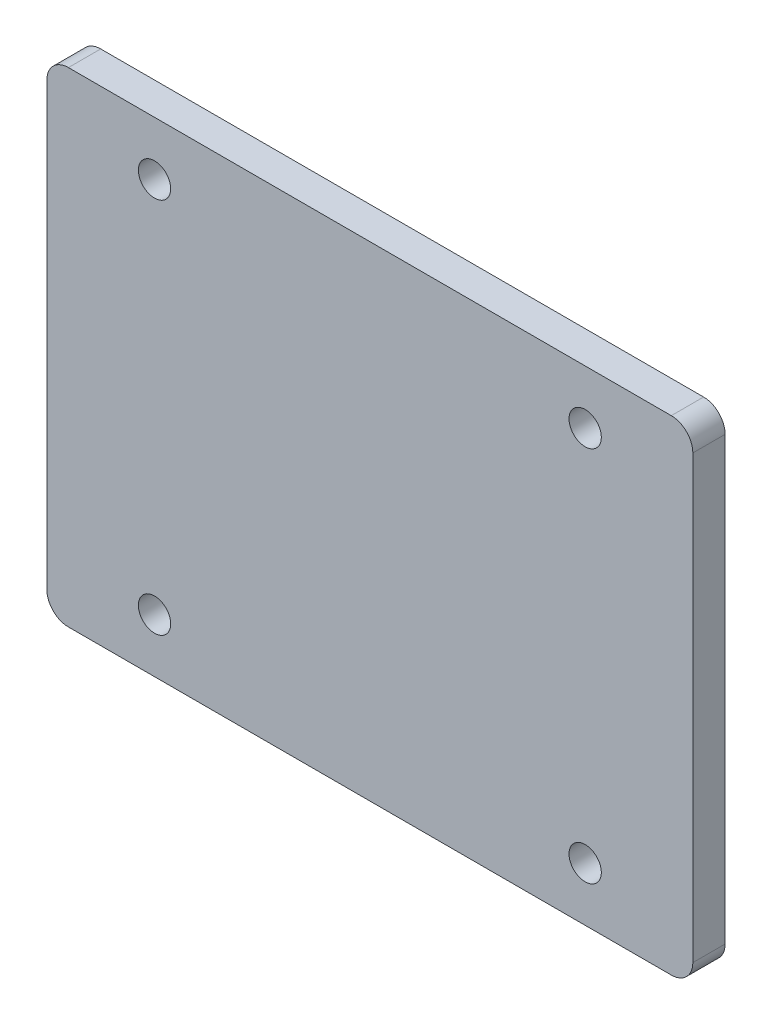
ISO-10303-21;
HEADER;
FILE_DESCRIPTION(('STEP AP214'),'2;1');
FILE_NAME('part.step','',(''),(''),'','','');
FILE_SCHEMA(('AUTOMOTIVE_DESIGN { 1 0 10303 214 1 1 1 1 }'));
ENDSEC;
DATA;
#1=APPLICATION_CONTEXT('core data for automotive mechanical design processes');
#2=APPLICATION_PROTOCOL_DEFINITION('international standard','automotive_design',2000,#1);
#3=PRODUCT_CONTEXT('',#1,'mechanical');
#4=PRODUCT('Part','Part','',(#3));
#5=PRODUCT_RELATED_PRODUCT_CATEGORY('part','',(#4));
#6=PRODUCT_DEFINITION_FORMATION('','',#4);
#7=PRODUCT_DEFINITION_CONTEXT('part definition',#1,'design');
#8=PRODUCT_DEFINITION('design','',#6,#7);
#9=PRODUCT_DEFINITION_SHAPE('','',#8);
#10=(LENGTH_UNIT() NAMED_UNIT(*) SI_UNIT(.MILLI.,.METRE.));
#11=(NAMED_UNIT(*) PLANE_ANGLE_UNIT() SI_UNIT($,.RADIAN.));
#12=(NAMED_UNIT(*) SI_UNIT($,.STERADIAN.) SOLID_ANGLE_UNIT());
#13=UNCERTAINTY_MEASURE_WITH_UNIT(LENGTH_MEASURE(1.E-05),#10,'distance_accuracy_value','');
#14=(GEOMETRIC_REPRESENTATION_CONTEXT(3) GLOBAL_UNCERTAINTY_ASSIGNED_CONTEXT((#13)) GLOBAL_UNIT_ASSIGNED_CONTEXT((#10,
#11,#12)) REPRESENTATION_CONTEXT('',''));
#15=CARTESIAN_POINT('',(0.,0.,0.));
#16=DIRECTION('',(0.,0.,1.));
#17=DIRECTION('',(1.,0.,0.));
#18=AXIS2_PLACEMENT_3D('',#15,#16,#17);
#19=CARTESIAN_POINT('',(0.,0.,3.));
#20=DIRECTION('',(1.,0.,0.));
#21=DIRECTION('',(0.,0.,-1.));
#22=AXIS2_PLACEMENT_3D('',#19,#20,#21);
#23=PLANE('',#22);
#24=DIRECTION('',(0.,-1.,0.));
#25=VECTOR('',#24,1.);
#26=CARTESIAN_POINT('',(0.,0.,0.));
#27=LINE('',#26,#25);
#28=CARTESIAN_POINT('',(0.,43.,0.));
#29=VERTEX_POINT('',#28);
#30=CARTESIAN_POINT('',(0.,2.,0.));
#31=VERTEX_POINT('',#30);
#32=EDGE_CURVE('E128',#29,#31,#27,.T.);
#33=ORIENTED_EDGE('',*,*,#32,.T.);
#34=DIRECTION('',(0.,0.,-1.));
#35=VECTOR('',#34,1.);
#36=CARTESIAN_POINT('',(0.,2.,3.));
#37=LINE('',#36,#35);
#38=CARTESIAN_POINT('',(0.,2.,3.));
#39=VERTEX_POINT('',#38);
#40=EDGE_CURVE('E151',#31,#39,#37,.F.);
#41=ORIENTED_EDGE('',*,*,#40,.T.);
#42=DIRECTION('',(0.,-1.,0.));
#43=VECTOR('',#42,1.);
#44=CARTESIAN_POINT('',(0.,0.,3.));
#45=LINE('',#44,#43);
#46=CARTESIAN_POINT('',(0.,43.,3.));
#47=VERTEX_POINT('',#46);
#48=EDGE_CURVE('E126',#47,#39,#45,.T.);
#49=ORIENTED_EDGE('',*,*,#48,.F.);
#50=DIRECTION('',(0.,0.,-1.));
#51=VECTOR('',#50,1.);
#52=CARTESIAN_POINT('',(0.,43.,3.));
#53=LINE('',#52,#51);
#54=EDGE_CURVE('E148',#47,#29,#53,.T.);
#55=ORIENTED_EDGE('',*,*,#54,.T.);
#56=EDGE_LOOP('',(#33,#41,#49,#55));
#57=FACE_BOUND('',#56,.T.);
#58=ADVANCED_FACE('F33',(#57),#23,.F.);
#59=CARTESIAN_POINT('',(0.,0.,3.));
#60=DIRECTION('',(0.,1.,0.));
#61=DIRECTION('',(0.,0.,1.));
#62=AXIS2_PLACEMENT_3D('',#59,#60,#61);
#63=PLANE('',#62);
#64=DIRECTION('',(1.,0.,0.));
#65=VECTOR('',#64,1.);
#66=CARTESIAN_POINT('',(0.,0.,0.));
#67=LINE('',#66,#65);
#68=CARTESIAN_POINT('',(2.,0.,0.));
#69=VERTEX_POINT('',#68);
#70=CARTESIAN_POINT('',(57.9999999999999,0.,0.));
#71=VERTEX_POINT('',#70);
#72=EDGE_CURVE('E124',#69,#71,#67,.T.);
#73=ORIENTED_EDGE('',*,*,#72,.T.);
#74=DIRECTION('',(0.,0.,-1.));
#75=VECTOR('',#74,1.);
#76=CARTESIAN_POINT('',(57.9999999999999,0.,3.));
#77=LINE('',#76,#75);
#78=CARTESIAN_POINT('',(57.9999999999999,0.,3.));
#79=VERTEX_POINT('',#78);
#80=EDGE_CURVE('E103',#71,#79,#77,.F.);
#81=ORIENTED_EDGE('',*,*,#80,.T.);
#82=DIRECTION('',(1.,0.,0.));
#83=VECTOR('',#82,1.);
#84=CARTESIAN_POINT('',(0.,0.,3.));
#85=LINE('',#84,#83);
#86=CARTESIAN_POINT('',(2.,0.,3.));
#87=VERTEX_POINT('',#86);
#88=EDGE_CURVE('E167',#87,#79,#85,.T.);
#89=ORIENTED_EDGE('',*,*,#88,.F.);
#90=DIRECTION('',(0.,0.,-1.));
#91=VECTOR('',#90,1.);
#92=CARTESIAN_POINT('',(2.,0.,3.));
#93=LINE('',#92,#91);
#94=EDGE_CURVE('E108',#87,#69,#93,.T.);
#95=ORIENTED_EDGE('',*,*,#94,.T.);
#96=EDGE_LOOP('',(#73,#81,#89,#95));
#97=FACE_BOUND('',#96,.T.);
#98=ADVANCED_FACE('F222',(#97),#63,.F.);
#99=CARTESIAN_POINT('',(59.9999999999999,0.,3.));
#100=DIRECTION('',(-1.,0.,0.));
#101=DIRECTION('',(0.,0.,1.));
#102=AXIS2_PLACEMENT_3D('',#99,#100,#101);
#103=PLANE('',#102);
#104=DIRECTION('',(0.,1.,0.));
#105=VECTOR('',#104,1.);
#106=CARTESIAN_POINT('',(59.9999999999999,0.,3.));
#107=LINE('',#106,#105);
#108=CARTESIAN_POINT('',(59.9999999999999,2.,3.));
#109=VERTEX_POINT('',#108);
#110=CARTESIAN_POINT('',(59.9999999999999,43.,3.));
#111=VERTEX_POINT('',#110);
#112=EDGE_CURVE('E117',#109,#111,#107,.T.);
#113=ORIENTED_EDGE('',*,*,#112,.F.);
#114=DIRECTION('',(0.,0.,-1.));
#115=VECTOR('',#114,1.);
#116=CARTESIAN_POINT('',(59.9999999999999,2.,3.));
#117=LINE('',#116,#115);
#118=CARTESIAN_POINT('',(59.9999999999999,2.,0.));
#119=VERTEX_POINT('',#118);
#120=EDGE_CURVE('E102',#109,#119,#117,.T.);
#121=ORIENTED_EDGE('',*,*,#120,.T.);
#122=DIRECTION('',(0.,1.,0.));
#123=VECTOR('',#122,1.);
#124=CARTESIAN_POINT('',(59.9999999999999,0.,0.));
#125=LINE('',#124,#123);
#126=CARTESIAN_POINT('',(59.9999999999999,43.,0.));
#127=VERTEX_POINT('',#126);
#128=EDGE_CURVE('E115',#119,#127,#125,.T.);
#129=ORIENTED_EDGE('',*,*,#128,.T.);
#130=DIRECTION('',(0.,0.,-1.));
#131=VECTOR('',#130,1.);
#132=CARTESIAN_POINT('',(59.9999999999999,43.,3.));
#133=LINE('',#132,#131);
#134=EDGE_CURVE('E119',#127,#111,#133,.F.);
#135=ORIENTED_EDGE('',*,*,#134,.T.);
#136=EDGE_LOOP('',(#113,#121,#129,#135));
#137=FACE_BOUND('',#136,.T.);
#138=ADVANCED_FACE('F114',(#137),#103,.F.);
#139=CARTESIAN_POINT('',(0.,45.,3.));
#140=DIRECTION('',(0.,-1.,0.));
#141=DIRECTION('',(0.,0.,-1.));
#142=AXIS2_PLACEMENT_3D('',#139,#140,#141);
#143=PLANE('',#142);
#144=DIRECTION('',(-1.,0.,0.));
#145=VECTOR('',#144,1.);
#146=CARTESIAN_POINT('',(0.,45.,0.));
#147=LINE('',#146,#145);
#148=CARTESIAN_POINT('',(57.9999999999999,45.,0.));
#149=VERTEX_POINT('',#148);
#150=CARTESIAN_POINT('',(2.,45.,0.));
#151=VERTEX_POINT('',#150);
#152=EDGE_CURVE('E123',#149,#151,#147,.T.);
#153=ORIENTED_EDGE('',*,*,#152,.T.);
#154=DIRECTION('',(0.,0.,-1.));
#155=VECTOR('',#154,1.);
#156=CARTESIAN_POINT('',(2.,45.,3.));
#157=LINE('',#156,#155);
#158=CARTESIAN_POINT('',(2.,45.,3.));
#159=VERTEX_POINT('',#158);
#160=EDGE_CURVE('E11',#151,#159,#157,.F.);
#161=ORIENTED_EDGE('',*,*,#160,.T.);
#162=DIRECTION('',(-1.,0.,0.));
#163=VECTOR('',#162,1.);
#164=CARTESIAN_POINT('',(0.,45.,3.));
#165=LINE('',#164,#163);
#166=CARTESIAN_POINT('',(57.9999999999999,45.,3.));
#167=VERTEX_POINT('',#166);
#168=EDGE_CURVE('E132',#167,#159,#165,.T.);
#169=ORIENTED_EDGE('',*,*,#168,.F.);
#170=DIRECTION('',(0.,0.,-1.));
#171=VECTOR('',#170,1.);
#172=CARTESIAN_POINT('',(57.9999999999999,45.,3.));
#173=LINE('',#172,#171);
#174=EDGE_CURVE('E41',#167,#149,#173,.T.);
#175=ORIENTED_EDGE('',*,*,#174,.T.);
#176=EDGE_LOOP('',(#153,#161,#169,#175));
#177=FACE_BOUND('',#176,.T.);
#178=ADVANCED_FACE('F154',(#177),#143,.F.);
#179=CARTESIAN_POINT('',(0.,0.,3.));
#180=DIRECTION('',(0.,0.,-1.));
#181=DIRECTION('',(-1.,0.,0.));
#182=AXIS2_PLACEMENT_3D('',#179,#180,#181);
#183=PLANE('',#182);
#184=CARTESIAN_POINT('',(50.0000000000085,5.,3.));
#185=DIRECTION('',(0.,0.,1.));
#186=DIRECTION('',(1.,0.,0.));
#187=AXIS2_PLACEMENT_3D('',#184,#185,#186);
#188=CIRCLE('',#187,1.5);
#189=CARTESIAN_POINT('',(51.5000000000085,5.,3.));
#190=VERTEX_POINT('',#189);
#191=EDGE_CURVE('E195',#190,#190,#188,.T.);
#192=ORIENTED_EDGE('',*,*,#191,.F.);
#193=EDGE_LOOP('',(#192));
#194=FACE_BOUND('',#193,.T.);
#195=CARTESIAN_POINT('',(9.99999999999545,4.99999999999773,3.));
#196=DIRECTION('',(0.,0.,1.));
#197=DIRECTION('',(1.,0.,0.));
#198=AXIS2_PLACEMENT_3D('',#195,#196,#197);
#199=CIRCLE('',#198,1.5);
#200=CARTESIAN_POINT('',(11.4999999999955,4.99999999999773,3.));
#201=VERTEX_POINT('',#200);
#202=EDGE_CURVE('E189',#201,#201,#199,.T.);
#203=ORIENTED_EDGE('',*,*,#202,.F.);
#204=EDGE_LOOP('',(#203));
#205=FACE_BOUND('',#204,.T.);
#206=CARTESIAN_POINT('',(50.0000000000056,39.999999999996,3.));
#207=DIRECTION('',(0.,0.,1.));
#208=DIRECTION('',(1.,0.,0.));
#209=AXIS2_PLACEMENT_3D('',#206,#207,#208);
#210=CIRCLE('',#209,1.5);
#211=CARTESIAN_POINT('',(51.5000000000057,39.999999999996,3.));
#212=VERTEX_POINT('',#211);
#213=EDGE_CURVE('E183',#212,#212,#210,.T.);
#214=ORIENTED_EDGE('',*,*,#213,.F.);
#215=EDGE_LOOP('',(#214));
#216=FACE_BOUND('',#215,.T.);
#217=CARTESIAN_POINT('',(9.99999999999545,39.999999999996,3.));
#218=DIRECTION('',(0.,0.,1.));
#219=DIRECTION('',(1.,0.,0.));
#220=AXIS2_PLACEMENT_3D('',#217,#218,#219);
#221=CIRCLE('',#220,1.5);
#222=CARTESIAN_POINT('',(11.4999999999955,39.999999999996,3.));
#223=VERTEX_POINT('',#222);
#224=EDGE_CURVE('E172',#223,#223,#221,.T.);
#225=ORIENTED_EDGE('',*,*,#224,.F.);
#226=EDGE_LOOP('',(#225));
#227=FACE_BOUND('',#226,.T.);
#228=ORIENTED_EDGE('',*,*,#88,.T.);
#229=CARTESIAN_POINT('',(57.9999999999999,2.,3.));
#230=DIRECTION('',(0.,0.,-1.));
#231=DIRECTION('',(-1.,0.,0.));
#232=AXIS2_PLACEMENT_3D('',#229,#230,#231);
#233=CIRCLE('',#232,2.);
#234=EDGE_CURVE('E146',#79,#109,#233,.F.);
#235=ORIENTED_EDGE('',*,*,#234,.T.);
#236=ORIENTED_EDGE('',*,*,#112,.T.);
#237=CARTESIAN_POINT('',(57.9999999999999,43.,3.));
#238=DIRECTION('',(0.,0.,-1.));
#239=DIRECTION('',(-1.,0.,0.));
#240=AXIS2_PLACEMENT_3D('',#237,#238,#239);
#241=CIRCLE('',#240,2.);
#242=EDGE_CURVE('E53',#111,#167,#241,.F.);
#243=ORIENTED_EDGE('',*,*,#242,.T.);
#244=ORIENTED_EDGE('',*,*,#168,.T.);
#245=CARTESIAN_POINT('',(2.,43.,3.));
#246=DIRECTION('',(0.,0.,-1.));
#247=DIRECTION('',(-1.,0.,0.));
#248=AXIS2_PLACEMENT_3D('',#245,#246,#247);
#249=CIRCLE('',#248,2.);
#250=EDGE_CURVE('E142',#159,#47,#249,.F.);
#251=ORIENTED_EDGE('',*,*,#250,.T.);
#252=ORIENTED_EDGE('',*,*,#48,.T.);
#253=CARTESIAN_POINT('',(2.,2.,3.));
#254=DIRECTION('',(0.,0.,-1.));
#255=DIRECTION('',(-1.,0.,0.));
#256=AXIS2_PLACEMENT_3D('',#253,#254,#255);
#257=CIRCLE('',#256,2.);
#258=EDGE_CURVE('E144',#39,#87,#257,.F.);
#259=ORIENTED_EDGE('',*,*,#258,.T.);
#260=EDGE_LOOP('',(#228,#235,#236,#243,#244,#251,#252,#259));
#261=FACE_BOUND('',#260,.T.);
#262=ADVANCED_FACE('F210',(#194,#205,#216,#227,#261),#183,.F.);
#263=CARTESIAN_POINT('',(0.,0.,0.));
#264=DIRECTION('',(0.,0.,-1.));
#265=DIRECTION('',(-1.,0.,0.));
#266=AXIS2_PLACEMENT_3D('',#263,#264,#265);
#267=PLANE('',#266);
#268=CARTESIAN_POINT('',(50.0000000000085,5.,0.));
#269=DIRECTION('',(0.,0.,1.));
#270=DIRECTION('',(1.,0.,0.));
#271=AXIS2_PLACEMENT_3D('',#268,#269,#270);
#272=CIRCLE('',#271,1.5);
#273=CARTESIAN_POINT('',(51.5000000000085,5.,0.));
#274=VERTEX_POINT('',#273);
#275=EDGE_CURVE('E192',#274,#274,#272,.T.);
#276=ORIENTED_EDGE('',*,*,#275,.T.);
#277=EDGE_LOOP('',(#276));
#278=FACE_BOUND('',#277,.T.);
#279=CARTESIAN_POINT('',(9.99999999999545,4.99999999999773,0.));
#280=DIRECTION('',(0.,0.,1.));
#281=DIRECTION('',(1.,0.,0.));
#282=AXIS2_PLACEMENT_3D('',#279,#280,#281);
#283=CIRCLE('',#282,1.5);
#284=CARTESIAN_POINT('',(11.4999999999955,4.99999999999773,0.));
#285=VERTEX_POINT('',#284);
#286=EDGE_CURVE('E186',#285,#285,#283,.T.);
#287=ORIENTED_EDGE('',*,*,#286,.T.);
#288=EDGE_LOOP('',(#287));
#289=FACE_BOUND('',#288,.T.);
#290=CARTESIAN_POINT('',(50.0000000000056,39.999999999996,0.));
#291=DIRECTION('',(0.,0.,1.));
#292=DIRECTION('',(1.,0.,0.));
#293=AXIS2_PLACEMENT_3D('',#290,#291,#292);
#294=CIRCLE('',#293,1.5);
#295=CARTESIAN_POINT('',(51.5000000000057,39.999999999996,0.));
#296=VERTEX_POINT('',#295);
#297=EDGE_CURVE('E181',#296,#296,#294,.T.);
#298=ORIENTED_EDGE('',*,*,#297,.T.);
#299=EDGE_LOOP('',(#298));
#300=FACE_BOUND('',#299,.T.);
#301=CARTESIAN_POINT('',(9.99999999999545,39.999999999996,0.));
#302=DIRECTION('',(0.,0.,1.));
#303=DIRECTION('',(1.,0.,0.));
#304=AXIS2_PLACEMENT_3D('',#301,#302,#303);
#305=CIRCLE('',#304,1.5);
#306=CARTESIAN_POINT('',(11.4999999999955,39.999999999996,0.));
#307=VERTEX_POINT('',#306);
#308=EDGE_CURVE('E176',#307,#307,#305,.T.);
#309=ORIENTED_EDGE('',*,*,#308,.T.);
#310=EDGE_LOOP('',(#309));
#311=FACE_BOUND('',#310,.T.);
#312=ORIENTED_EDGE('',*,*,#128,.F.);
#313=CARTESIAN_POINT('',(57.9999999999999,2.,0.));
#314=DIRECTION('',(0.,0.,-1.));
#315=DIRECTION('',(-1.,0.,0.));
#316=AXIS2_PLACEMENT_3D('',#313,#314,#315);
#317=CIRCLE('',#316,2.);
#318=EDGE_CURVE('E98',#119,#71,#317,.T.);
#319=ORIENTED_EDGE('',*,*,#318,.T.);
#320=ORIENTED_EDGE('',*,*,#72,.F.);
#321=CARTESIAN_POINT('',(2.,2.,0.));
#322=DIRECTION('',(0.,0.,-1.));
#323=DIRECTION('',(-1.,0.,0.));
#324=AXIS2_PLACEMENT_3D('',#321,#322,#323);
#325=CIRCLE('',#324,2.);
#326=EDGE_CURVE('E109',#69,#31,#325,.T.);
#327=ORIENTED_EDGE('',*,*,#326,.T.);
#328=ORIENTED_EDGE('',*,*,#32,.F.);
#329=CARTESIAN_POINT('',(2.,43.,0.));
#330=DIRECTION('',(0.,0.,-1.));
#331=DIRECTION('',(-1.,0.,0.));
#332=AXIS2_PLACEMENT_3D('',#329,#330,#331);
#333=CIRCLE('',#332,2.);
#334=EDGE_CURVE('E135',#29,#151,#333,.T.);
#335=ORIENTED_EDGE('',*,*,#334,.T.);
#336=ORIENTED_EDGE('',*,*,#152,.F.);
#337=CARTESIAN_POINT('',(57.9999999999999,43.,0.));
#338=DIRECTION('',(0.,0.,-1.));
#339=DIRECTION('',(-1.,0.,0.));
#340=AXIS2_PLACEMENT_3D('',#337,#338,#339);
#341=CIRCLE('',#340,2.);
#342=EDGE_CURVE('E118',#149,#127,#341,.T.);
#343=ORIENTED_EDGE('',*,*,#342,.T.);
#344=EDGE_LOOP('',(#312,#319,#320,#327,#328,#335,#336,#343));
#345=FACE_BOUND('',#344,.T.);
#346=ADVANCED_FACE('F121',(#278,#289,#300,#311,#345),#267,.T.);
#347=CARTESIAN_POINT('',(57.9999999999999,2.,3.));
#348=DIRECTION('',(0.,0.,-1.));
#349=DIRECTION('',(-1.,0.,0.));
#350=AXIS2_PLACEMENT_3D('',#347,#348,#349);
#351=CYLINDRICAL_SURFACE('',#350,2.);
#352=ORIENTED_EDGE('',*,*,#234,.F.);
#353=ORIENTED_EDGE('',*,*,#80,.F.);
#354=ORIENTED_EDGE('',*,*,#318,.F.);
#355=ORIENTED_EDGE('',*,*,#120,.F.);
#356=EDGE_LOOP('',(#352,#353,#354,#355));
#357=FACE_BOUND('',#356,.T.);
#358=ADVANCED_FACE('F101',(#357),#351,.T.);
#359=CARTESIAN_POINT('',(2.,2.,3.));
#360=DIRECTION('',(0.,0.,-1.));
#361=DIRECTION('',(-1.,0.,0.));
#362=AXIS2_PLACEMENT_3D('',#359,#360,#361);
#363=CYLINDRICAL_SURFACE('',#362,2.);
#364=ORIENTED_EDGE('',*,*,#258,.F.);
#365=ORIENTED_EDGE('',*,*,#40,.F.);
#366=ORIENTED_EDGE('',*,*,#326,.F.);
#367=ORIENTED_EDGE('',*,*,#94,.F.);
#368=EDGE_LOOP('',(#364,#365,#366,#367));
#369=FACE_BOUND('',#368,.T.);
#370=ADVANCED_FACE('F224',(#369),#363,.T.);
#371=CARTESIAN_POINT('',(2.,43.,3.));
#372=DIRECTION('',(0.,0.,-1.));
#373=DIRECTION('',(-1.,0.,0.));
#374=AXIS2_PLACEMENT_3D('',#371,#372,#373);
#375=CYLINDRICAL_SURFACE('',#374,2.);
#376=ORIENTED_EDGE('',*,*,#250,.F.);
#377=ORIENTED_EDGE('',*,*,#160,.F.);
#378=ORIENTED_EDGE('',*,*,#334,.F.);
#379=ORIENTED_EDGE('',*,*,#54,.F.);
#380=EDGE_LOOP('',(#376,#377,#378,#379));
#381=FACE_BOUND('',#380,.T.);
#382=ADVANCED_FACE('F161',(#381),#375,.T.);
#383=CARTESIAN_POINT('',(57.9999999999999,43.,3.));
#384=DIRECTION('',(0.,0.,-1.));
#385=DIRECTION('',(-1.,0.,0.));
#386=AXIS2_PLACEMENT_3D('',#383,#384,#385);
#387=CYLINDRICAL_SURFACE('',#386,2.);
#388=ORIENTED_EDGE('',*,*,#242,.F.);
#389=ORIENTED_EDGE('',*,*,#134,.F.);
#390=ORIENTED_EDGE('',*,*,#342,.F.);
#391=ORIENTED_EDGE('',*,*,#174,.F.);
#392=EDGE_LOOP('',(#388,#389,#390,#391));
#393=FACE_BOUND('',#392,.T.);
#394=ADVANCED_FACE('F35',(#393),#387,.T.);
#395=CARTESIAN_POINT('',(9.99999999999545,39.999999999996,0.));
#396=DIRECTION('',(0.,0.,1.));
#397=DIRECTION('',(1.,0.,0.));
#398=AXIS2_PLACEMENT_3D('',#395,#396,#397);
#399=CYLINDRICAL_SURFACE('',#398,1.5);
#400=ORIENTED_EDGE('',*,*,#308,.F.);
#401=EDGE_LOOP('',(#400));
#402=FACE_BOUND('',#401,.T.);
#403=ORIENTED_EDGE('',*,*,#224,.T.);
#404=EDGE_LOOP('',(#403));
#405=FACE_BOUND('',#404,.T.);
#406=ADVANCED_FACE('F245',(#402,#405),#399,.F.);
#407=CARTESIAN_POINT('',(50.0000000000056,39.999999999996,0.));
#408=DIRECTION('',(0.,0.,1.));
#409=DIRECTION('',(1.,0.,0.));
#410=AXIS2_PLACEMENT_3D('',#407,#408,#409);
#411=CYLINDRICAL_SURFACE('',#410,1.5);
#412=ORIENTED_EDGE('',*,*,#297,.F.);
#413=EDGE_LOOP('',(#412));
#414=FACE_BOUND('',#413,.T.);
#415=ORIENTED_EDGE('',*,*,#213,.T.);
#416=EDGE_LOOP('',(#415));
#417=FACE_BOUND('',#416,.T.);
#418=ADVANCED_FACE('F248',(#414,#417),#411,.F.);
#419=CARTESIAN_POINT('',(9.99999999999545,4.99999999999773,0.));
#420=DIRECTION('',(0.,0.,1.));
#421=DIRECTION('',(1.,0.,0.));
#422=AXIS2_PLACEMENT_3D('',#419,#420,#421);
#423=CYLINDRICAL_SURFACE('',#422,1.5);
#424=ORIENTED_EDGE('',*,*,#286,.F.);
#425=EDGE_LOOP('',(#424));
#426=FACE_BOUND('',#425,.T.);
#427=ORIENTED_EDGE('',*,*,#202,.T.);
#428=EDGE_LOOP('',(#427));
#429=FACE_BOUND('',#428,.T.);
#430=ADVANCED_FACE('F206',(#426,#429),#423,.F.);
#431=CARTESIAN_POINT('',(50.0000000000085,5.,0.));
#432=DIRECTION('',(0.,0.,1.));
#433=DIRECTION('',(1.,0.,0.));
#434=AXIS2_PLACEMENT_3D('',#431,#432,#433);
#435=CYLINDRICAL_SURFACE('',#434,1.5);
#436=ORIENTED_EDGE('',*,*,#275,.F.);
#437=EDGE_LOOP('',(#436));
#438=FACE_BOUND('',#437,.T.);
#439=ORIENTED_EDGE('',*,*,#191,.T.);
#440=EDGE_LOOP('',(#439));
#441=FACE_BOUND('',#440,.T.);
#442=ADVANCED_FACE('F203',(#438,#441),#435,.F.);
#443=CLOSED_SHELL('',(#58,#98,#138,#178,#262,#346,#358,#370,#382,#394,#406,#418,#430,#442));
#444=MANIFOLD_SOLID_BREP('B2',#443);
#445=ADVANCED_BREP_SHAPE_REPRESENTATION('',(#18,#444),#14);
#446=SHAPE_DEFINITION_REPRESENTATION(#9,#445);
ENDSEC;
END-ISO-10303-21;
